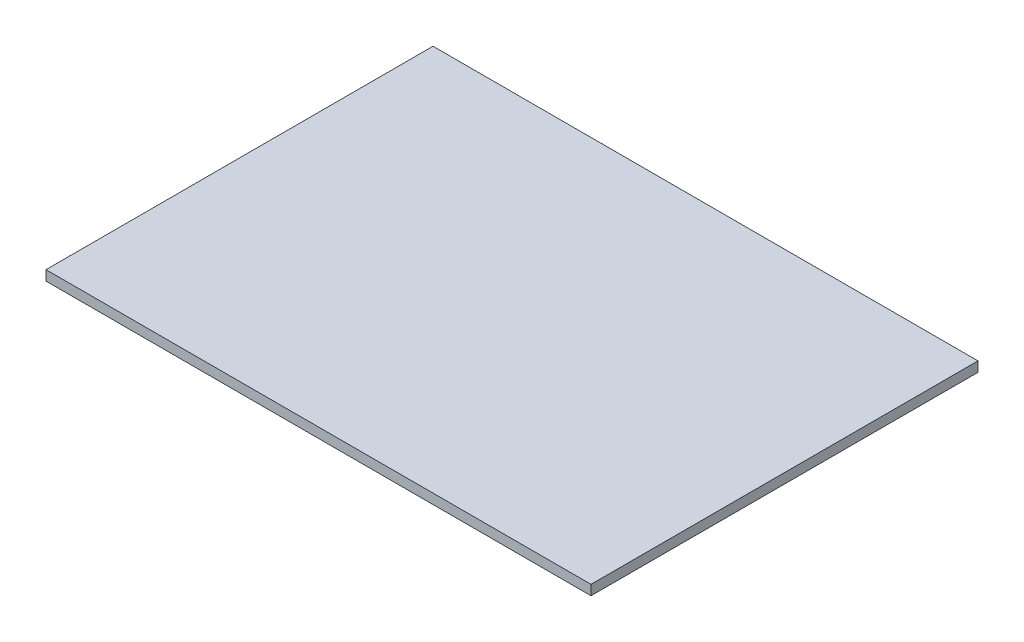
ISO-10303-21;
HEADER;
FILE_DESCRIPTION(('STEP AP214'),'2;1');
FILE_NAME('part.step','',(''),(''),'','','');
FILE_SCHEMA(('AUTOMOTIVE_DESIGN { 1 0 10303 214 1 1 1 1 }'));
ENDSEC;
DATA;
#1=APPLICATION_CONTEXT('core data for automotive mechanical design processes');
#2=APPLICATION_PROTOCOL_DEFINITION('international standard','automotive_design',2000,#1);
#3=PRODUCT_CONTEXT('',#1,'mechanical');
#4=PRODUCT('Part','Part','',(#3));
#5=PRODUCT_RELATED_PRODUCT_CATEGORY('part','',(#4));
#6=PRODUCT_DEFINITION_FORMATION('','',#4);
#7=PRODUCT_DEFINITION_CONTEXT('part definition',#1,'design');
#8=PRODUCT_DEFINITION('design','',#6,#7);
#9=PRODUCT_DEFINITION_SHAPE('','',#8);
#10=(LENGTH_UNIT() NAMED_UNIT(*) SI_UNIT(.MILLI.,.METRE.));
#11=(NAMED_UNIT(*) PLANE_ANGLE_UNIT() SI_UNIT($,.RADIAN.));
#12=(NAMED_UNIT(*) SI_UNIT($,.STERADIAN.) SOLID_ANGLE_UNIT());
#13=UNCERTAINTY_MEASURE_WITH_UNIT(LENGTH_MEASURE(1.E-05),#10,'distance_accuracy_value','');
#14=(GEOMETRIC_REPRESENTATION_CONTEXT(3) GLOBAL_UNCERTAINTY_ASSIGNED_CONTEXT((#13)) GLOBAL_UNIT_ASSIGNED_CONTEXT((#10,
#11,#12)) REPRESENTATION_CONTEXT('',''));
#15=CARTESIAN_POINT('',(0.,0.,0.));
#16=DIRECTION('',(0.,0.,1.));
#17=DIRECTION('',(1.,0.,0.));
#18=AXIS2_PLACEMENT_3D('',#15,#16,#17);
#19=CARTESIAN_POINT('',(27.4700041710021,-1.,-19.5063655030801));
#20=DIRECTION('',(1.,0.,0.));
#21=DIRECTION('',(0.,0.,-1.));
#22=AXIS2_PLACEMENT_3D('',#19,#20,#21);
#23=PLANE('',#22);
#24=DIRECTION('',(0.,0.,-1.));
#25=VECTOR('',#24,1.);
#26=CARTESIAN_POINT('',(27.4700041710021,0.,-19.5063655030801));
#27=LINE('',#26,#25);
#28=CARTESIAN_POINT('',(27.4700041710021,0.,19.5063655030801));
#29=VERTEX_POINT('',#28);
#30=CARTESIAN_POINT('',(27.4700041710021,0.,-19.5063655030801));
#31=VERTEX_POINT('',#30);
#32=EDGE_CURVE('E98',#29,#31,#27,.T.);
#33=ORIENTED_EDGE('',*,*,#32,.F.);
#34=DIRECTION('',(0.,1.,0.));
#35=VECTOR('',#34,1.);
#36=CARTESIAN_POINT('',(27.4700041710021,-1.,19.5063655030801));
#37=LINE('',#36,#35);
#38=CARTESIAN_POINT('',(27.4700041710021,-1.,19.5063655030801));
#39=VERTEX_POINT('',#38);
#40=EDGE_CURVE('E11',#39,#29,#37,.T.);
#41=ORIENTED_EDGE('',*,*,#40,.F.);
#42=DIRECTION('',(0.,0.,-1.));
#43=VECTOR('',#42,1.);
#44=CARTESIAN_POINT('',(27.4700041710021,-1.,-19.5063655030801));
#45=LINE('',#44,#43);
#46=CARTESIAN_POINT('',(27.4700041710021,-1.,-19.5063655030801));
#47=VERTEX_POINT('',#46);
#48=EDGE_CURVE('E92',#39,#47,#45,.T.);
#49=ORIENTED_EDGE('',*,*,#48,.T.);
#50=DIRECTION('',(0.,1.,0.));
#51=VECTOR('',#50,1.);
#52=CARTESIAN_POINT('',(27.4700041710021,-1.,-19.5063655030801));
#53=LINE('',#52,#51);
#54=EDGE_CURVE('E37',#47,#31,#53,.T.);
#55=ORIENTED_EDGE('',*,*,#54,.T.);
#56=EDGE_LOOP('',(#33,#41,#49,#55));
#57=FACE_BOUND('',#56,.T.);
#58=ADVANCED_FACE('F34',(#57),#23,.T.);
#59=CARTESIAN_POINT('',(-27.4700041710021,-1.,19.5063655030801));
#60=DIRECTION('',(0.,0.,1.));
#61=DIRECTION('',(1.,0.,0.));
#62=AXIS2_PLACEMENT_3D('',#59,#60,#61);
#63=PLANE('',#62);
#64=DIRECTION('',(1.,0.,0.));
#65=VECTOR('',#64,1.);
#66=CARTESIAN_POINT('',(-27.4700041710021,0.,19.5063655030801));
#67=LINE('',#66,#65);
#68=CARTESIAN_POINT('',(-27.4700041710021,0.,19.5063655030801));
#69=VERTEX_POINT('',#68);
#70=EDGE_CURVE('E94',#69,#29,#67,.T.);
#71=ORIENTED_EDGE('',*,*,#70,.F.);
#72=DIRECTION('',(0.,1.,0.));
#73=VECTOR('',#72,1.);
#74=CARTESIAN_POINT('',(-27.4700041710021,-1.,19.5063655030801));
#75=LINE('',#74,#73);
#76=CARTESIAN_POINT('',(-27.4700041710021,-1.,19.5063655030801));
#77=VERTEX_POINT('',#76);
#78=EDGE_CURVE('E43',#77,#69,#75,.T.);
#79=ORIENTED_EDGE('',*,*,#78,.F.);
#80=DIRECTION('',(1.,0.,0.));
#81=VECTOR('',#80,1.);
#82=CARTESIAN_POINT('',(-27.4700041710021,-1.,19.5063655030801));
#83=LINE('',#82,#81);
#84=EDGE_CURVE('E89',#77,#39,#83,.T.);
#85=ORIENTED_EDGE('',*,*,#84,.T.);
#86=ORIENTED_EDGE('',*,*,#40,.T.);
#87=EDGE_LOOP('',(#71,#79,#85,#86));
#88=FACE_BOUND('',#87,.T.);
#89=ADVANCED_FACE('F108',(#88),#63,.T.);
#90=CARTESIAN_POINT('',(-27.4700041710021,-1.,-19.5063655030801));
#91=DIRECTION('',(-1.,0.,0.));
#92=DIRECTION('',(0.,0.,1.));
#93=AXIS2_PLACEMENT_3D('',#90,#91,#92);
#94=PLANE('',#93);
#95=DIRECTION('',(0.,0.,1.));
#96=VECTOR('',#95,1.);
#97=CARTESIAN_POINT('',(-27.4700041710021,0.,-19.5063655030801));
#98=LINE('',#97,#96);
#99=CARTESIAN_POINT('',(-27.4700041710021,0.,-19.5063655030801));
#100=VERTEX_POINT('',#99);
#101=EDGE_CURVE('E84',#100,#69,#98,.T.);
#102=ORIENTED_EDGE('',*,*,#101,.F.);
#103=DIRECTION('',(0.,1.,0.));
#104=VECTOR('',#103,1.);
#105=CARTESIAN_POINT('',(-27.4700041710021,-1.,-19.5063655030801));
#106=LINE('',#105,#104);
#107=CARTESIAN_POINT('',(-27.4700041710021,-1.,-19.5063655030801));
#108=VERTEX_POINT('',#107);
#109=EDGE_CURVE('E79',#108,#100,#106,.T.);
#110=ORIENTED_EDGE('',*,*,#109,.F.);
#111=DIRECTION('',(0.,0.,1.));
#112=VECTOR('',#111,1.);
#113=CARTESIAN_POINT('',(-27.4700041710021,-1.,-19.5063655030801));
#114=LINE('',#113,#112);
#115=EDGE_CURVE('E82',#108,#77,#114,.T.);
#116=ORIENTED_EDGE('',*,*,#115,.T.);
#117=ORIENTED_EDGE('',*,*,#78,.T.);
#118=EDGE_LOOP('',(#102,#110,#116,#117));
#119=FACE_BOUND('',#118,.T.);
#120=ADVANCED_FACE('F81',(#119),#94,.T.);
#121=CARTESIAN_POINT('',(-27.4700041710021,-1.,-19.5063655030801));
#122=DIRECTION('',(0.,0.,-1.));
#123=DIRECTION('',(-1.,0.,0.));
#124=AXIS2_PLACEMENT_3D('',#121,#122,#123);
#125=PLANE('',#124);
#126=DIRECTION('',(-1.,0.,0.));
#127=VECTOR('',#126,1.);
#128=CARTESIAN_POINT('',(-27.4700041710021,0.,-19.5063655030801));
#129=LINE('',#128,#127);
#130=EDGE_CURVE('E101',#31,#100,#129,.T.);
#131=ORIENTED_EDGE('',*,*,#130,.F.);
#132=ORIENTED_EDGE('',*,*,#54,.F.);
#133=DIRECTION('',(-1.,0.,0.));
#134=VECTOR('',#133,1.);
#135=CARTESIAN_POINT('',(-27.4700041710021,-1.,-19.5063655030801));
#136=LINE('',#135,#134);
#137=EDGE_CURVE('E88',#47,#108,#136,.T.);
#138=ORIENTED_EDGE('',*,*,#137,.T.);
#139=ORIENTED_EDGE('',*,*,#109,.T.);
#140=EDGE_LOOP('',(#131,#132,#138,#139));
#141=FACE_BOUND('',#140,.T.);
#142=ADVANCED_FACE('F91',(#141),#125,.T.);
#143=CARTESIAN_POINT('',(0.,-1.,0.));
#144=DIRECTION('',(0.,1.,0.));
#145=DIRECTION('',(0.,0.,1.));
#146=AXIS2_PLACEMENT_3D('',#143,#144,#145);
#147=PLANE('',#146);
#148=ORIENTED_EDGE('',*,*,#48,.F.);
#149=ORIENTED_EDGE('',*,*,#84,.F.);
#150=ORIENTED_EDGE('',*,*,#115,.F.);
#151=ORIENTED_EDGE('',*,*,#137,.F.);
#152=EDGE_LOOP('',(#148,#149,#150,#151));
#153=FACE_BOUND('',#152,.T.);
#154=ADVANCED_FACE('F87',(#153),#147,.F.);
#155=CARTESIAN_POINT('',(0.,0.,0.));
#156=DIRECTION('',(0.,1.,0.));
#157=DIRECTION('',(0.,0.,1.));
#158=AXIS2_PLACEMENT_3D('',#155,#156,#157);
#159=PLANE('',#158);
#160=ORIENTED_EDGE('',*,*,#32,.T.);
#161=ORIENTED_EDGE('',*,*,#130,.T.);
#162=ORIENTED_EDGE('',*,*,#101,.T.);
#163=ORIENTED_EDGE('',*,*,#70,.T.);
#164=EDGE_LOOP('',(#160,#161,#162,#163));
#165=FACE_BOUND('',#164,.T.);
#166=ADVANCED_FACE('F107',(#165),#159,.T.);
#167=CLOSED_SHELL('',(#58,#89,#120,#142,#154,#166));
#168=MANIFOLD_SOLID_BREP('B2',#167);
#169=ADVANCED_BREP_SHAPE_REPRESENTATION('',(#18,#168),#14);
#170=SHAPE_DEFINITION_REPRESENTATION(#9,#169);
ENDSEC;
END-ISO-10303-21;
